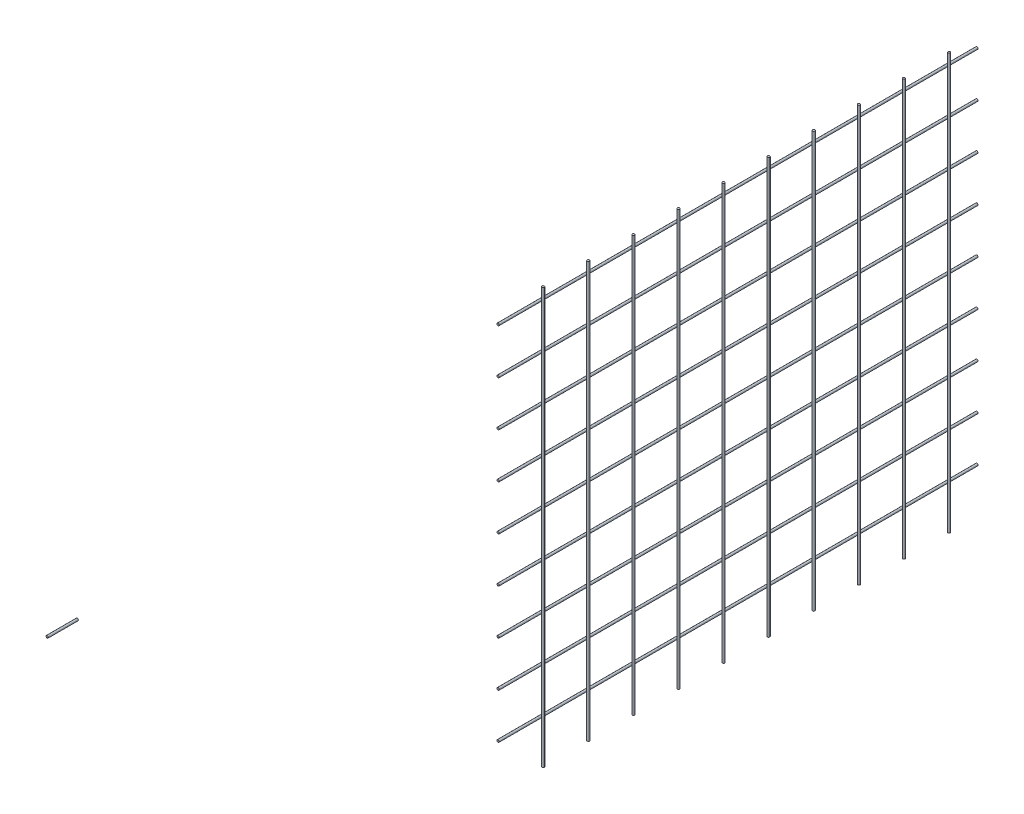
ISO-10303-21;
HEADER;
FILE_DESCRIPTION(('STEP AP214'),'2;1');
FILE_NAME('part.step','',(''),(''),'','','');
FILE_SCHEMA(('AUTOMOTIVE_DESIGN { 1 0 10303 214 1 1 1 1 }'));
ENDSEC;
DATA;
#1=APPLICATION_CONTEXT('core data for automotive mechanical design processes');
#2=APPLICATION_PROTOCOL_DEFINITION('international standard','automotive_design',2000,#1);
#3=PRODUCT_CONTEXT('',#1,'mechanical');
#4=PRODUCT('Part','Part','',(#3));
#5=PRODUCT_RELATED_PRODUCT_CATEGORY('part','',(#4));
#6=PRODUCT_DEFINITION_FORMATION('','',#4);
#7=PRODUCT_DEFINITION_CONTEXT('part definition',#1,'design');
#8=PRODUCT_DEFINITION('design','',#6,#7);
#9=PRODUCT_DEFINITION_SHAPE('','',#8);
#10=(LENGTH_UNIT() NAMED_UNIT(*) SI_UNIT(.MILLI.,.METRE.));
#11=(NAMED_UNIT(*) PLANE_ANGLE_UNIT() SI_UNIT($,.RADIAN.));
#12=(NAMED_UNIT(*) SI_UNIT($,.STERADIAN.) SOLID_ANGLE_UNIT());
#13=UNCERTAINTY_MEASURE_WITH_UNIT(LENGTH_MEASURE(1.E-05),#10,'distance_accuracy_value','');
#14=(GEOMETRIC_REPRESENTATION_CONTEXT(3) GLOBAL_UNCERTAINTY_ASSIGNED_CONTEXT((#13)) GLOBAL_UNIT_ASSIGNED_CONTEXT((#10,
#11,#12)) REPRESENTATION_CONTEXT('',''));
#15=CARTESIAN_POINT('',(0.,0.,0.));
#16=DIRECTION('',(0.,0.,1.));
#17=DIRECTION('',(1.,0.,0.));
#18=AXIS2_PLACEMENT_3D('',#15,#16,#17);
#19=CARTESIAN_POINT('',(-20.01,1256.5,-2403.));
#20=DIRECTION('',(0.,0.,1.));
#21=DIRECTION('',(1.,0.,0.));
#22=AXIS2_PLACEMENT_3D('',#19,#20,#21);
#23=PLANE('',#22);
#24=CARTESIAN_POINT('',(0.,760.,-2403.));
#25=DIRECTION('',(0.,0.,1.));
#26=DIRECTION('',(1.,0.,0.));
#27=AXIS2_PLACEMENT_3D('',#24,#25,#26);
#28=CIRCLE('',#27,1.49999999999986);
#29=CARTESIAN_POINT('',(1.49999999999986,760.,-2403.));
#30=VERTEX_POINT('',#29);
#31=EDGE_CURVE('E56',#30,#30,#28,.T.);
#32=ORIENTED_EDGE('',*,*,#31,.T.);
#33=EDGE_LOOP('',(#32));
#34=FACE_BOUND('',#33,.T.);
#35=ADVANCED_FACE('F52',(#34),#23,.T.);
#36=CARTESIAN_POINT('',(0.,760.,-3080.002));
#37=DIRECTION('',(0.,0.,1.));
#38=DIRECTION('',(1.,0.,0.));
#39=AXIS2_PLACEMENT_3D('',#36,#37,#38);
#40=CYLINDRICAL_SURFACE('',#39,1.49999999999986);
#41=CARTESIAN_POINT('',(0.,760.,-3040.));
#42=DIRECTION('',(0.,0.,-1.));
#43=DIRECTION('',(-1.,0.,0.));
#44=AXIS2_PLACEMENT_3D('',#41,#42,#43);
#45=CIRCLE('',#44,1.49999999999986);
#46=CARTESIAN_POINT('',(-1.49999999999986,760.,-3040.));
#47=VERTEX_POINT('',#46);
#48=EDGE_CURVE('E11',#47,#47,#45,.T.);
#49=ORIENTED_EDGE('',*,*,#48,.F.);
#50=EDGE_LOOP('',(#49));
#51=FACE_BOUND('',#50,.T.);
#52=ORIENTED_EDGE('',*,*,#31,.F.);
#53=EDGE_LOOP('',(#52));
#54=FACE_BOUND('',#53,.T.);
#55=ADVANCED_FACE('F54',(#51,#54),#40,.T.);
#56=CARTESIAN_POINT('',(-15.5,-2.22044604925031E-13,-3040.));
#57=DIRECTION('',(0.,0.,-1.));
#58=DIRECTION('',(-1.,0.,0.));
#59=AXIS2_PLACEMENT_3D('',#56,#57,#58);
#60=PLANE('',#59);
#61=ORIENTED_EDGE('',*,*,#48,.T.);
#62=EDGE_LOOP('',(#61));
#63=FACE_BOUND('',#62,.T.);
#64=ADVANCED_FACE('F67',(#63),#60,.T.);
#65=CLOSED_SHELL('',(#35,#55,#64));
#66=MANIFOLD_SOLID_BREP('B2',#65);
#67=CARTESIAN_POINT('',(-20.01,1256.5,-2403.));
#68=DIRECTION('',(0.,0.,1.));
#69=DIRECTION('',(1.,0.,0.));
#70=AXIS2_PLACEMENT_3D('',#67,#68,#69);
#71=PLANE('',#70);
#72=CARTESIAN_POINT('',(0.,820.,-2403.));
#73=DIRECTION('',(0.,0.,1.));
#74=DIRECTION('',(1.,0.,0.));
#75=AXIS2_PLACEMENT_3D('',#72,#73,#74);
#76=CIRCLE('',#75,1.49999999999986);
#77=CARTESIAN_POINT('',(1.49999999999986,820.,-2403.));
#78=VERTEX_POINT('',#77);
#79=EDGE_CURVE('E105',#78,#78,#76,.T.);
#80=ORIENTED_EDGE('',*,*,#79,.T.);
#81=EDGE_LOOP('',(#80));
#82=FACE_BOUND('',#81,.T.);
#83=ADVANCED_FACE('F101',(#82),#71,.T.);
#84=CARTESIAN_POINT('',(0.,820.,-3080.002));
#85=DIRECTION('',(0.,0.,1.));
#86=DIRECTION('',(1.,0.,0.));
#87=AXIS2_PLACEMENT_3D('',#84,#85,#86);
#88=CYLINDRICAL_SURFACE('',#87,1.49999999999986);
#89=CARTESIAN_POINT('',(0.,820.,-3040.));
#90=DIRECTION('',(0.,0.,-1.));
#91=DIRECTION('',(-1.,0.,0.));
#92=AXIS2_PLACEMENT_3D('',#89,#90,#91);
#93=CIRCLE('',#92,1.49999999999986);
#94=CARTESIAN_POINT('',(-1.49999999999986,820.,-3040.));
#95=VERTEX_POINT('',#94);
#96=EDGE_CURVE('E51',#95,#95,#93,.T.);
#97=ORIENTED_EDGE('',*,*,#96,.F.);
#98=EDGE_LOOP('',(#97));
#99=FACE_BOUND('',#98,.T.);
#100=ORIENTED_EDGE('',*,*,#79,.F.);
#101=EDGE_LOOP('',(#100));
#102=FACE_BOUND('',#101,.T.);
#103=ADVANCED_FACE('F103',(#99,#102),#88,.T.);
#104=CARTESIAN_POINT('',(-15.5,-2.22044604925031E-13,-3040.));
#105=DIRECTION('',(0.,0.,-1.));
#106=DIRECTION('',(-1.,0.,0.));
#107=AXIS2_PLACEMENT_3D('',#104,#105,#106);
#108=PLANE('',#107);
#109=ORIENTED_EDGE('',*,*,#96,.T.);
#110=EDGE_LOOP('',(#109));
#111=FACE_BOUND('',#110,.T.);
#112=ADVANCED_FACE('F116',(#111),#108,.T.);
#113=CLOSED_SHELL('',(#83,#103,#112));
#114=MANIFOLD_SOLID_BREP('B6',#113);
#115=CARTESIAN_POINT('',(-20.01,1256.5,-2403.));
#116=DIRECTION('',(0.,0.,1.));
#117=DIRECTION('',(1.,0.,0.));
#118=AXIS2_PLACEMENT_3D('',#115,#116,#117);
#119=PLANE('',#118);
#120=CARTESIAN_POINT('',(0.,880.,-2403.));
#121=DIRECTION('',(0.,0.,1.));
#122=DIRECTION('',(1.,0.,0.));
#123=AXIS2_PLACEMENT_3D('',#120,#121,#122);
#124=CIRCLE('',#123,1.49999999999986);
#125=CARTESIAN_POINT('',(1.49999999999986,880.,-2403.));
#126=VERTEX_POINT('',#125);
#127=EDGE_CURVE('E154',#126,#126,#124,.T.);
#128=ORIENTED_EDGE('',*,*,#127,.T.);
#129=EDGE_LOOP('',(#128));
#130=FACE_BOUND('',#129,.T.);
#131=ADVANCED_FACE('F150',(#130),#119,.T.);
#132=CARTESIAN_POINT('',(0.,880.,-3080.002));
#133=DIRECTION('',(0.,0.,1.));
#134=DIRECTION('',(1.,0.,0.));
#135=AXIS2_PLACEMENT_3D('',#132,#133,#134);
#136=CYLINDRICAL_SURFACE('',#135,1.49999999999986);
#137=CARTESIAN_POINT('',(0.,880.,-3040.));
#138=DIRECTION('',(0.,0.,-1.));
#139=DIRECTION('',(-1.,0.,0.));
#140=AXIS2_PLACEMENT_3D('',#137,#138,#139);
#141=CIRCLE('',#140,1.49999999999986);
#142=CARTESIAN_POINT('',(-1.49999999999986,880.,-3040.));
#143=VERTEX_POINT('',#142);
#144=EDGE_CURVE('E100',#143,#143,#141,.T.);
#145=ORIENTED_EDGE('',*,*,#144,.F.);
#146=EDGE_LOOP('',(#145));
#147=FACE_BOUND('',#146,.T.);
#148=ORIENTED_EDGE('',*,*,#127,.F.);
#149=EDGE_LOOP('',(#148));
#150=FACE_BOUND('',#149,.T.);
#151=ADVANCED_FACE('F152',(#147,#150),#136,.T.);
#152=CARTESIAN_POINT('',(-15.5,-2.22044604925031E-13,-3040.));
#153=DIRECTION('',(0.,0.,-1.));
#154=DIRECTION('',(-1.,0.,0.));
#155=AXIS2_PLACEMENT_3D('',#152,#153,#154);
#156=PLANE('',#155);
#157=ORIENTED_EDGE('',*,*,#144,.T.);
#158=EDGE_LOOP('',(#157));
#159=FACE_BOUND('',#158,.T.);
#160=ADVANCED_FACE('F165',(#159),#156,.T.);
#161=CLOSED_SHELL('',(#131,#151,#160));
#162=MANIFOLD_SOLID_BREP('B46',#161);
#163=CARTESIAN_POINT('',(-20.01,1256.5,-2403.));
#164=DIRECTION('',(0.,0.,1.));
#165=DIRECTION('',(1.,0.,0.));
#166=AXIS2_PLACEMENT_3D('',#163,#164,#165);
#167=PLANE('',#166);
#168=CARTESIAN_POINT('',(0.,940.,-2403.));
#169=DIRECTION('',(0.,0.,1.));
#170=DIRECTION('',(1.,0.,0.));
#171=AXIS2_PLACEMENT_3D('',#168,#169,#170);
#172=CIRCLE('',#171,1.49999999999986);
#173=CARTESIAN_POINT('',(1.49999999999986,940.,-2403.));
#174=VERTEX_POINT('',#173);
#175=EDGE_CURVE('E203',#174,#174,#172,.T.);
#176=ORIENTED_EDGE('',*,*,#175,.T.);
#177=EDGE_LOOP('',(#176));
#178=FACE_BOUND('',#177,.T.);
#179=ADVANCED_FACE('F199',(#178),#167,.T.);
#180=CARTESIAN_POINT('',(0.,940.,-3080.002));
#181=DIRECTION('',(0.,0.,1.));
#182=DIRECTION('',(1.,0.,0.));
#183=AXIS2_PLACEMENT_3D('',#180,#181,#182);
#184=CYLINDRICAL_SURFACE('',#183,1.49999999999986);
#185=CARTESIAN_POINT('',(0.,940.,-3040.));
#186=DIRECTION('',(0.,0.,-1.));
#187=DIRECTION('',(-1.,0.,0.));
#188=AXIS2_PLACEMENT_3D('',#185,#186,#187);
#189=CIRCLE('',#188,1.49999999999986);
#190=CARTESIAN_POINT('',(-1.49999999999986,940.,-3040.));
#191=VERTEX_POINT('',#190);
#192=EDGE_CURVE('E149',#191,#191,#189,.T.);
#193=ORIENTED_EDGE('',*,*,#192,.F.);
#194=EDGE_LOOP('',(#193));
#195=FACE_BOUND('',#194,.T.);
#196=ORIENTED_EDGE('',*,*,#175,.F.);
#197=EDGE_LOOP('',(#196));
#198=FACE_BOUND('',#197,.T.);
#199=ADVANCED_FACE('F201',(#195,#198),#184,.T.);
#200=CARTESIAN_POINT('',(-15.5,-2.22044604925031E-13,-3040.));
#201=DIRECTION('',(0.,0.,-1.));
#202=DIRECTION('',(-1.,0.,0.));
#203=AXIS2_PLACEMENT_3D('',#200,#201,#202);
#204=PLANE('',#203);
#205=ORIENTED_EDGE('',*,*,#192,.T.);
#206=EDGE_LOOP('',(#205));
#207=FACE_BOUND('',#206,.T.);
#208=ADVANCED_FACE('F214',(#207),#204,.T.);
#209=CLOSED_SHELL('',(#179,#199,#208));
#210=MANIFOLD_SOLID_BREP('B95',#209);
#211=CARTESIAN_POINT('',(-20.01,1256.5,-2403.));
#212=DIRECTION('',(0.,0.,1.));
#213=DIRECTION('',(1.,0.,0.));
#214=AXIS2_PLACEMENT_3D('',#211,#212,#213);
#215=PLANE('',#214);
#216=CARTESIAN_POINT('',(0.,1000.,-2403.));
#217=DIRECTION('',(0.,0.,1.));
#218=DIRECTION('',(1.,0.,0.));
#219=AXIS2_PLACEMENT_3D('',#216,#217,#218);
#220=CIRCLE('',#219,1.49999999999986);
#221=CARTESIAN_POINT('',(1.49999999999986,1000.,-2403.));
#222=VERTEX_POINT('',#221);
#223=EDGE_CURVE('E252',#222,#222,#220,.T.);
#224=ORIENTED_EDGE('',*,*,#223,.T.);
#225=EDGE_LOOP('',(#224));
#226=FACE_BOUND('',#225,.T.);
#227=ADVANCED_FACE('F248',(#226),#215,.T.);
#228=CARTESIAN_POINT('',(0.,1000.,-3080.002));
#229=DIRECTION('',(0.,0.,1.));
#230=DIRECTION('',(1.,0.,0.));
#231=AXIS2_PLACEMENT_3D('',#228,#229,#230);
#232=CYLINDRICAL_SURFACE('',#231,1.49999999999986);
#233=CARTESIAN_POINT('',(0.,1000.,-3040.));
#234=DIRECTION('',(0.,0.,-1.));
#235=DIRECTION('',(-1.,0.,0.));
#236=AXIS2_PLACEMENT_3D('',#233,#234,#235);
#237=CIRCLE('',#236,1.49999999999986);
#238=CARTESIAN_POINT('',(-1.49999999999986,1000.,-3040.));
#239=VERTEX_POINT('',#238);
#240=EDGE_CURVE('E198',#239,#239,#237,.T.);
#241=ORIENTED_EDGE('',*,*,#240,.F.);
#242=EDGE_LOOP('',(#241));
#243=FACE_BOUND('',#242,.T.);
#244=ORIENTED_EDGE('',*,*,#223,.F.);
#245=EDGE_LOOP('',(#244));
#246=FACE_BOUND('',#245,.T.);
#247=ADVANCED_FACE('F250',(#243,#246),#232,.T.);
#248=CARTESIAN_POINT('',(-15.5,-2.22044604925031E-13,-3040.));
#249=DIRECTION('',(0.,0.,-1.));
#250=DIRECTION('',(-1.,0.,0.));
#251=AXIS2_PLACEMENT_3D('',#248,#249,#250);
#252=PLANE('',#251);
#253=ORIENTED_EDGE('',*,*,#240,.T.);
#254=EDGE_LOOP('',(#253));
#255=FACE_BOUND('',#254,.T.);
#256=ADVANCED_FACE('F263',(#255),#252,.T.);
#257=CLOSED_SHELL('',(#227,#247,#256));
#258=MANIFOLD_SOLID_BREP('B144',#257);
#259=CARTESIAN_POINT('',(-20.01,1256.5,-2403.));
#260=DIRECTION('',(0.,0.,1.));
#261=DIRECTION('',(1.,0.,0.));
#262=AXIS2_PLACEMENT_3D('',#259,#260,#261);
#263=PLANE('',#262);
#264=CARTESIAN_POINT('',(0.,1060.,-2403.));
#265=DIRECTION('',(0.,0.,1.));
#266=DIRECTION('',(1.,0.,0.));
#267=AXIS2_PLACEMENT_3D('',#264,#265,#266);
#268=CIRCLE('',#267,1.49999999999986);
#269=CARTESIAN_POINT('',(1.49999999999986,1060.,-2403.));
#270=VERTEX_POINT('',#269);
#271=EDGE_CURVE('E301',#270,#270,#268,.T.);
#272=ORIENTED_EDGE('',*,*,#271,.T.);
#273=EDGE_LOOP('',(#272));
#274=FACE_BOUND('',#273,.T.);
#275=ADVANCED_FACE('F297',(#274),#263,.T.);
#276=CARTESIAN_POINT('',(0.,1060.,-3080.002));
#277=DIRECTION('',(0.,0.,1.));
#278=DIRECTION('',(1.,0.,0.));
#279=AXIS2_PLACEMENT_3D('',#276,#277,#278);
#280=CYLINDRICAL_SURFACE('',#279,1.49999999999986);
#281=CARTESIAN_POINT('',(0.,1060.,-3040.));
#282=DIRECTION('',(0.,0.,-1.));
#283=DIRECTION('',(-1.,0.,0.));
#284=AXIS2_PLACEMENT_3D('',#281,#282,#283);
#285=CIRCLE('',#284,1.49999999999986);
#286=CARTESIAN_POINT('',(-1.49999999999986,1060.,-3040.));
#287=VERTEX_POINT('',#286);
#288=EDGE_CURVE('E247',#287,#287,#285,.T.);
#289=ORIENTED_EDGE('',*,*,#288,.F.);
#290=EDGE_LOOP('',(#289));
#291=FACE_BOUND('',#290,.T.);
#292=ORIENTED_EDGE('',*,*,#271,.F.);
#293=EDGE_LOOP('',(#292));
#294=FACE_BOUND('',#293,.T.);
#295=ADVANCED_FACE('F299',(#291,#294),#280,.T.);
#296=CARTESIAN_POINT('',(-15.5,-2.22044604925031E-13,-3040.));
#297=DIRECTION('',(0.,0.,-1.));
#298=DIRECTION('',(-1.,0.,0.));
#299=AXIS2_PLACEMENT_3D('',#296,#297,#298);
#300=PLANE('',#299);
#301=ORIENTED_EDGE('',*,*,#288,.T.);
#302=EDGE_LOOP('',(#301));
#303=FACE_BOUND('',#302,.T.);
#304=ADVANCED_FACE('F313',(#303),#300,.T.);
#305=CLOSED_SHELL('',(#275,#295,#304));
#306=MANIFOLD_SOLID_BREP('B193',#305);
#307=CARTESIAN_POINT('',(-20.01,1256.5,-2403.));
#308=DIRECTION('',(0.,0.,1.));
#309=DIRECTION('',(1.,0.,0.));
#310=AXIS2_PLACEMENT_3D('',#307,#308,#309);
#311=PLANE('',#310);
#312=CARTESIAN_POINT('',(0.,1120.,-2403.));
#313=DIRECTION('',(0.,0.,1.));
#314=DIRECTION('',(1.,0.,0.));
#315=AXIS2_PLACEMENT_3D('',#312,#313,#314);
#316=CIRCLE('',#315,1.49999999999986);
#317=CARTESIAN_POINT('',(1.49999999999986,1120.,-2403.));
#318=VERTEX_POINT('',#317);
#319=EDGE_CURVE('E351',#318,#318,#316,.T.);
#320=ORIENTED_EDGE('',*,*,#319,.T.);
#321=EDGE_LOOP('',(#320));
#322=FACE_BOUND('',#321,.T.);
#323=ADVANCED_FACE('F347',(#322),#311,.T.);
#324=CARTESIAN_POINT('',(0.,1120.,-3080.002));
#325=DIRECTION('',(0.,0.,1.));
#326=DIRECTION('',(1.,0.,0.));
#327=AXIS2_PLACEMENT_3D('',#324,#325,#326);
#328=CYLINDRICAL_SURFACE('',#327,1.49999999999986);
#329=CARTESIAN_POINT('',(0.,1120.,-3040.));
#330=DIRECTION('',(0.,0.,-1.));
#331=DIRECTION('',(-1.,0.,0.));
#332=AXIS2_PLACEMENT_3D('',#329,#330,#331);
#333=CIRCLE('',#332,1.49999999999986);
#334=CARTESIAN_POINT('',(-1.49999999999986,1120.,-3040.));
#335=VERTEX_POINT('',#334);
#336=EDGE_CURVE('E296',#335,#335,#333,.T.);
#337=ORIENTED_EDGE('',*,*,#336,.F.);
#338=EDGE_LOOP('',(#337));
#339=FACE_BOUND('',#338,.T.);
#340=ORIENTED_EDGE('',*,*,#319,.F.);
#341=EDGE_LOOP('',(#340));
#342=FACE_BOUND('',#341,.T.);
#343=ADVANCED_FACE('F349',(#339,#342),#328,.T.);
#344=CARTESIAN_POINT('',(-15.5,-2.22044604925031E-13,-3040.));
#345=DIRECTION('',(0.,0.,-1.));
#346=DIRECTION('',(-1.,0.,0.));
#347=AXIS2_PLACEMENT_3D('',#344,#345,#346);
#348=PLANE('',#347);
#349=ORIENTED_EDGE('',*,*,#336,.T.);
#350=EDGE_LOOP('',(#349));
#351=FACE_BOUND('',#350,.T.);
#352=ADVANCED_FACE('F363',(#351),#348,.T.);
#353=CLOSED_SHELL('',(#323,#343,#352));
#354=MANIFOLD_SOLID_BREP('B242',#353);
#355=CARTESIAN_POINT('',(-20.01,1256.5,-2403.));
#356=DIRECTION('',(0.,0.,1.));
#357=DIRECTION('',(1.,0.,0.));
#358=AXIS2_PLACEMENT_3D('',#355,#356,#357);
#359=PLANE('',#358);
#360=CARTESIAN_POINT('',(0.,1180.,-2403.));
#361=DIRECTION('',(0.,0.,1.));
#362=DIRECTION('',(1.,0.,0.));
#363=AXIS2_PLACEMENT_3D('',#360,#361,#362);
#364=CIRCLE('',#363,1.49999999999986);
#365=CARTESIAN_POINT('',(1.49999999999986,1180.,-2403.));
#366=VERTEX_POINT('',#365);
#367=EDGE_CURVE('E401',#366,#366,#364,.T.);
#368=ORIENTED_EDGE('',*,*,#367,.T.);
#369=EDGE_LOOP('',(#368));
#370=FACE_BOUND('',#369,.T.);
#371=ADVANCED_FACE('F397',(#370),#359,.T.);
#372=CARTESIAN_POINT('',(0.,1180.,-3080.002));
#373=DIRECTION('',(0.,0.,1.));
#374=DIRECTION('',(1.,0.,0.));
#375=AXIS2_PLACEMENT_3D('',#372,#373,#374);
#376=CYLINDRICAL_SURFACE('',#375,1.49999999999986);
#377=CARTESIAN_POINT('',(0.,1180.,-3040.));
#378=DIRECTION('',(0.,0.,-1.));
#379=DIRECTION('',(-1.,0.,0.));
#380=AXIS2_PLACEMENT_3D('',#377,#378,#379);
#381=CIRCLE('',#380,1.49999999999986);
#382=CARTESIAN_POINT('',(-1.49999999999986,1180.,-3040.));
#383=VERTEX_POINT('',#382);
#384=EDGE_CURVE('E346',#383,#383,#381,.T.);
#385=ORIENTED_EDGE('',*,*,#384,.F.);
#386=EDGE_LOOP('',(#385));
#387=FACE_BOUND('',#386,.T.);
#388=ORIENTED_EDGE('',*,*,#367,.F.);
#389=EDGE_LOOP('',(#388));
#390=FACE_BOUND('',#389,.T.);
#391=ADVANCED_FACE('F399',(#387,#390),#376,.T.);
#392=CARTESIAN_POINT('',(-15.5,-2.22044604925031E-13,-3040.));
#393=DIRECTION('',(0.,0.,-1.));
#394=DIRECTION('',(-1.,0.,0.));
#395=AXIS2_PLACEMENT_3D('',#392,#393,#394);
#396=PLANE('',#395);
#397=ORIENTED_EDGE('',*,*,#384,.T.);
#398=EDGE_LOOP('',(#397));
#399=FACE_BOUND('',#398,.T.);
#400=ADVANCED_FACE('F412',(#399),#396,.T.);
#401=CLOSED_SHELL('',(#371,#391,#400));
#402=MANIFOLD_SOLID_BREP('B291',#401);
#403=CARTESIAN_POINT('',(-20.01,1256.5,-2403.));
#404=DIRECTION('',(0.,0.,1.));
#405=DIRECTION('',(1.,0.,0.));
#406=AXIS2_PLACEMENT_3D('',#403,#404,#405);
#407=PLANE('',#406);
#408=CARTESIAN_POINT('',(0.,1240.,-2403.));
#409=DIRECTION('',(0.,0.,1.));
#410=DIRECTION('',(1.,0.,0.));
#411=AXIS2_PLACEMENT_3D('',#408,#409,#410);
#412=CIRCLE('',#411,1.49999999999986);
#413=CARTESIAN_POINT('',(1.49999999999986,1240.,-2403.));
#414=VERTEX_POINT('',#413);
#415=EDGE_CURVE('E450',#414,#414,#412,.T.);
#416=ORIENTED_EDGE('',*,*,#415,.T.);
#417=EDGE_LOOP('',(#416));
#418=FACE_BOUND('',#417,.T.);
#419=ADVANCED_FACE('F446',(#418),#407,.T.);
#420=CARTESIAN_POINT('',(0.,1240.,-3080.002));
#421=DIRECTION('',(0.,0.,1.));
#422=DIRECTION('',(1.,0.,0.));
#423=AXIS2_PLACEMENT_3D('',#420,#421,#422);
#424=CYLINDRICAL_SURFACE('',#423,1.49999999999986);
#425=CARTESIAN_POINT('',(0.,1240.,-3040.));
#426=DIRECTION('',(0.,0.,-1.));
#427=DIRECTION('',(-1.,0.,0.));
#428=AXIS2_PLACEMENT_3D('',#425,#426,#427);
#429=CIRCLE('',#428,1.49999999999986);
#430=CARTESIAN_POINT('',(-1.49999999999986,1240.,-3040.));
#431=VERTEX_POINT('',#430);
#432=EDGE_CURVE('E396',#431,#431,#429,.T.);
#433=ORIENTED_EDGE('',*,*,#432,.F.);
#434=EDGE_LOOP('',(#433));
#435=FACE_BOUND('',#434,.T.);
#436=ORIENTED_EDGE('',*,*,#415,.F.);
#437=EDGE_LOOP('',(#436));
#438=FACE_BOUND('',#437,.T.);
#439=ADVANCED_FACE('F448',(#435,#438),#424,.T.);
#440=CARTESIAN_POINT('',(-15.5,-2.22044604925031E-13,-3040.));
#441=DIRECTION('',(0.,0.,-1.));
#442=DIRECTION('',(-1.,0.,0.));
#443=AXIS2_PLACEMENT_3D('',#440,#441,#442);
#444=PLANE('',#443);
#445=ORIENTED_EDGE('',*,*,#432,.T.);
#446=EDGE_LOOP('',(#445));
#447=FACE_BOUND('',#446,.T.);
#448=ADVANCED_FACE('F461',(#447),#444,.T.);
#449=CLOSED_SHELL('',(#419,#439,#448));
#450=MANIFOLD_SOLID_BREP('B341',#449);
#451=CARTESIAN_POINT('',(-20.01,1256.5,-1803.));
#452=DIRECTION('',(0.,0.,-1.));
#453=DIRECTION('',(0.,1.,0.));
#454=AXIS2_PLACEMENT_3D('',#451,#452,#453);
#455=PLANE('',#454);
#456=CARTESIAN_POINT('',(0.,1180.,-1803.));
#457=DIRECTION('',(0.,0.,-1.));
#458=DIRECTION('',(0.,1.,0.));
#459=AXIS2_PLACEMENT_3D('',#456,#457,#458);
#460=CIRCLE('',#459,1.49999999999986);
#461=CARTESIAN_POINT('',(0.,1181.5,-1803.));
#462=VERTEX_POINT('',#461);
#463=EDGE_CURVE('E445',#462,#462,#460,.T.);
#464=ORIENTED_EDGE('',*,*,#463,.F.);
#465=EDGE_LOOP('',(#464));
#466=FACE_BOUND('',#465,.T.);
#467=ADVANCED_FACE('F495',(#466),#455,.F.);
#468=CARTESIAN_POINT('',(-11.,1249.,-1843.));
#469=DIRECTION('',(0.,0.,1.));
#470=DIRECTION('',(1.,0.,0.));
#471=AXIS2_PLACEMENT_3D('',#468,#469,#470);
#472=PLANE('',#471);
#473=CARTESIAN_POINT('',(0.,1180.,-1843.));
#474=DIRECTION('',(0.,0.,1.));
#475=DIRECTION('',(1.,0.,0.));
#476=AXIS2_PLACEMENT_3D('',#473,#474,#475);
#477=CIRCLE('',#476,1.49999999999986);
#478=CARTESIAN_POINT('',(1.49999999999986,1180.,-1843.));
#479=VERTEX_POINT('',#478);
#480=EDGE_CURVE('E502',#479,#479,#477,.T.);
#481=ORIENTED_EDGE('',*,*,#480,.F.);
#482=EDGE_LOOP('',(#481));
#483=FACE_BOUND('',#482,.T.);
#484=ADVANCED_FACE('F511',(#483),#472,.F.);
#485=CARTESIAN_POINT('',(0.,1180.,-3080.002));
#486=DIRECTION('',(0.,0.,1.));
#487=DIRECTION('',(1.,0.,0.));
#488=AXIS2_PLACEMENT_3D('',#485,#486,#487);
#489=CYLINDRICAL_SURFACE('',#488,1.49999999999986);
#490=ORIENTED_EDGE('',*,*,#463,.T.);
#491=EDGE_LOOP('',(#490));
#492=FACE_BOUND('',#491,.T.);
#493=ORIENTED_EDGE('',*,*,#480,.T.);
#494=EDGE_LOOP('',(#493));
#495=FACE_BOUND('',#494,.T.);
#496=ADVANCED_FACE('F509',(#492,#495),#489,.T.);
#497=CLOSED_SHELL('',(#467,#484,#496));
#498=MANIFOLD_SOLID_BREP('B391',#497);
#499=CARTESIAN_POINT('',(-20.01,703.5,-2403.));
#500=DIRECTION('',(0.,-1.,0.));
#501=DIRECTION('',(0.,0.,-1.));
#502=AXIS2_PLACEMENT_3D('',#499,#500,#501);
#503=PLANE('',#502);
#504=CARTESIAN_POINT('',(2.99999999999999,703.5,-3000.));
#505=DIRECTION('',(0.,-1.,0.));
#506=DIRECTION('',(0.,0.,-1.));
#507=AXIS2_PLACEMENT_3D('',#504,#505,#506);
#508=CIRCLE('',#507,1.5);
#509=CARTESIAN_POINT('',(2.99999999999999,703.5,-3001.5));
#510=VERTEX_POINT('',#509);
#511=EDGE_CURVE('E494',#510,#510,#508,.T.);
#512=ORIENTED_EDGE('',*,*,#511,.T.);
#513=EDGE_LOOP('',(#512));
#514=FACE_BOUND('',#513,.T.);
#515=ADVANCED_FACE('F548',(#514),#503,.T.);
#516=CARTESIAN_POINT('',(-20.01,1256.5,-2403.));
#517=DIRECTION('',(0.,1.,0.));
#518=DIRECTION('',(0.,0.,1.));
#519=AXIS2_PLACEMENT_3D('',#516,#517,#518);
#520=PLANE('',#519);
#521=CARTESIAN_POINT('',(2.99999999999999,1256.5,-3000.));
#522=DIRECTION('',(0.,1.,0.));
#523=DIRECTION('',(0.,0.,1.));
#524=AXIS2_PLACEMENT_3D('',#521,#522,#523);
#525=CIRCLE('',#524,1.5);
#526=CARTESIAN_POINT('',(2.99999999999999,1256.5,-2998.5));
#527=VERTEX_POINT('',#526);
#528=EDGE_CURVE('E555',#527,#527,#525,.T.);
#529=ORIENTED_EDGE('',*,*,#528,.T.);
#530=EDGE_LOOP('',(#529));
#531=FACE_BOUND('',#530,.T.);
#532=ADVANCED_FACE('F561',(#531),#520,.T.);
#533=CARTESIAN_POINT('',(2.99999999999999,1980.002,-3000.));
#534=DIRECTION('',(0.,-1.,0.));
#535=DIRECTION('',(0.,0.,-1.));
#536=AXIS2_PLACEMENT_3D('',#533,#534,#535);
#537=CYLINDRICAL_SURFACE('',#536,1.5);
#538=ORIENTED_EDGE('',*,*,#528,.F.);
#539=EDGE_LOOP('',(#538));
#540=FACE_BOUND('',#539,.T.);
#541=ORIENTED_EDGE('',*,*,#511,.F.);
#542=EDGE_LOOP('',(#541));
#543=FACE_BOUND('',#542,.T.);
#544=ADVANCED_FACE('F550',(#540,#543),#537,.T.);
#545=CLOSED_SHELL('',(#515,#532,#544));
#546=MANIFOLD_SOLID_BREP('B440',#545);
#547=CARTESIAN_POINT('',(-20.01,703.5,-2403.));
#548=DIRECTION('',(0.,-1.,0.));
#549=DIRECTION('',(0.,0.,-1.));
#550=AXIS2_PLACEMENT_3D('',#547,#548,#549);
#551=PLANE('',#550);
#552=CARTESIAN_POINT('',(2.99999999999999,703.5,-2940.));
#553=DIRECTION('',(0.,-1.,0.));
#554=DIRECTION('',(0.,0.,-1.));
#555=AXIS2_PLACEMENT_3D('',#552,#553,#554);
#556=CIRCLE('',#555,1.5);
#557=CARTESIAN_POINT('',(2.99999999999999,703.5,-2941.5));
#558=VERTEX_POINT('',#557);
#559=EDGE_CURVE('E547',#558,#558,#556,.T.);
#560=ORIENTED_EDGE('',*,*,#559,.T.);
#561=EDGE_LOOP('',(#560));
#562=FACE_BOUND('',#561,.T.);
#563=ADVANCED_FACE('F597',(#562),#551,.T.);
#564=CARTESIAN_POINT('',(-20.01,1256.5,-2403.));
#565=DIRECTION('',(0.,1.,0.));
#566=DIRECTION('',(0.,0.,1.));
#567=AXIS2_PLACEMENT_3D('',#564,#565,#566);
#568=PLANE('',#567);
#569=CARTESIAN_POINT('',(2.99999999999999,1256.5,-2940.));
#570=DIRECTION('',(0.,1.,0.));
#571=DIRECTION('',(0.,0.,1.));
#572=AXIS2_PLACEMENT_3D('',#569,#570,#571);
#573=CIRCLE('',#572,1.5);
#574=CARTESIAN_POINT('',(2.99999999999999,1256.5,-2938.5));
#575=VERTEX_POINT('',#574);
#576=EDGE_CURVE('E604',#575,#575,#573,.T.);
#577=ORIENTED_EDGE('',*,*,#576,.T.);
#578=EDGE_LOOP('',(#577));
#579=FACE_BOUND('',#578,.T.);
#580=ADVANCED_FACE('F610',(#579),#568,.T.);
#581=CARTESIAN_POINT('',(2.99999999999999,1980.002,-2940.));
#582=DIRECTION('',(0.,-1.,0.));
#583=DIRECTION('',(0.,0.,-1.));
#584=AXIS2_PLACEMENT_3D('',#581,#582,#583);
#585=CYLINDRICAL_SURFACE('',#584,1.5);
#586=ORIENTED_EDGE('',*,*,#576,.F.);
#587=EDGE_LOOP('',(#586));
#588=FACE_BOUND('',#587,.T.);
#589=ORIENTED_EDGE('',*,*,#559,.F.);
#590=EDGE_LOOP('',(#589));
#591=FACE_BOUND('',#590,.T.);
#592=ADVANCED_FACE('F599',(#588,#591),#585,.T.);
#593=CLOSED_SHELL('',(#563,#580,#592));
#594=MANIFOLD_SOLID_BREP('B489',#593);
#595=CARTESIAN_POINT('',(-20.01,703.5,-2403.));
#596=DIRECTION('',(0.,-1.,0.));
#597=DIRECTION('',(0.,0.,-1.));
#598=AXIS2_PLACEMENT_3D('',#595,#596,#597);
#599=PLANE('',#598);
#600=CARTESIAN_POINT('',(2.99999999999999,703.5,-2880.));
#601=DIRECTION('',(0.,-1.,0.));
#602=DIRECTION('',(0.,0.,-1.));
#603=AXIS2_PLACEMENT_3D('',#600,#601,#602);
#604=CIRCLE('',#603,1.5);
#605=CARTESIAN_POINT('',(2.99999999999999,703.5,-2881.5));
#606=VERTEX_POINT('',#605);
#607=EDGE_CURVE('E596',#606,#606,#604,.T.);
#608=ORIENTED_EDGE('',*,*,#607,.T.);
#609=EDGE_LOOP('',(#608));
#610=FACE_BOUND('',#609,.T.);
#611=ADVANCED_FACE('F646',(#610),#599,.T.);
#612=CARTESIAN_POINT('',(-20.01,1256.5,-2403.));
#613=DIRECTION('',(0.,1.,0.));
#614=DIRECTION('',(0.,0.,1.));
#615=AXIS2_PLACEMENT_3D('',#612,#613,#614);
#616=PLANE('',#615);
#617=CARTESIAN_POINT('',(2.99999999999999,1256.5,-2880.));
#618=DIRECTION('',(0.,1.,0.));
#619=DIRECTION('',(0.,0.,1.));
#620=AXIS2_PLACEMENT_3D('',#617,#618,#619);
#621=CIRCLE('',#620,1.5);
#622=CARTESIAN_POINT('',(2.99999999999999,1256.5,-2878.5));
#623=VERTEX_POINT('',#622);
#624=EDGE_CURVE('E653',#623,#623,#621,.T.);
#625=ORIENTED_EDGE('',*,*,#624,.T.);
#626=EDGE_LOOP('',(#625));
#627=FACE_BOUND('',#626,.T.);
#628=ADVANCED_FACE('F659',(#627),#616,.T.);
#629=CARTESIAN_POINT('',(2.99999999999999,1980.002,-2880.));
#630=DIRECTION('',(0.,-1.,0.));
#631=DIRECTION('',(0.,0.,-1.));
#632=AXIS2_PLACEMENT_3D('',#629,#630,#631);
#633=CYLINDRICAL_SURFACE('',#632,1.5);
#634=ORIENTED_EDGE('',*,*,#624,.F.);
#635=EDGE_LOOP('',(#634));
#636=FACE_BOUND('',#635,.T.);
#637=ORIENTED_EDGE('',*,*,#607,.F.);
#638=EDGE_LOOP('',(#637));
#639=FACE_BOUND('',#638,.T.);
#640=ADVANCED_FACE('F648',(#636,#639),#633,.T.);
#641=CLOSED_SHELL('',(#611,#628,#640));
#642=MANIFOLD_SOLID_BREP('B542',#641);
#643=CARTESIAN_POINT('',(-20.01,703.5,-2403.));
#644=DIRECTION('',(0.,-1.,0.));
#645=DIRECTION('',(0.,0.,-1.));
#646=AXIS2_PLACEMENT_3D('',#643,#644,#645);
#647=PLANE('',#646);
#648=CARTESIAN_POINT('',(2.99999999999999,703.5,-2820.));
#649=DIRECTION('',(0.,-1.,0.));
#650=DIRECTION('',(0.,0.,-1.));
#651=AXIS2_PLACEMENT_3D('',#648,#649,#650);
#652=CIRCLE('',#651,1.5);
#653=CARTESIAN_POINT('',(2.99999999999999,703.5,-2821.5));
#654=VERTEX_POINT('',#653);
#655=EDGE_CURVE('E645',#654,#654,#652,.T.);
#656=ORIENTED_EDGE('',*,*,#655,.T.);
#657=EDGE_LOOP('',(#656));
#658=FACE_BOUND('',#657,.T.);
#659=ADVANCED_FACE('F695',(#658),#647,.T.);
#660=CARTESIAN_POINT('',(-20.01,1256.5,-2403.));
#661=DIRECTION('',(0.,1.,0.));
#662=DIRECTION('',(0.,0.,1.));
#663=AXIS2_PLACEMENT_3D('',#660,#661,#662);
#664=PLANE('',#663);
#665=CARTESIAN_POINT('',(2.99999999999999,1256.5,-2820.));
#666=DIRECTION('',(0.,1.,0.));
#667=DIRECTION('',(0.,0.,1.));
#668=AXIS2_PLACEMENT_3D('',#665,#666,#667);
#669=CIRCLE('',#668,1.5);
#670=CARTESIAN_POINT('',(2.99999999999999,1256.5,-2818.5));
#671=VERTEX_POINT('',#670);
#672=EDGE_CURVE('E702',#671,#671,#669,.T.);
#673=ORIENTED_EDGE('',*,*,#672,.T.);
#674=EDGE_LOOP('',(#673));
#675=FACE_BOUND('',#674,.T.);
#676=ADVANCED_FACE('F708',(#675),#664,.T.);
#677=CARTESIAN_POINT('',(2.99999999999999,1980.002,-2820.));
#678=DIRECTION('',(0.,-1.,0.));
#679=DIRECTION('',(0.,0.,-1.));
#680=AXIS2_PLACEMENT_3D('',#677,#678,#679);
#681=CYLINDRICAL_SURFACE('',#680,1.5);
#682=ORIENTED_EDGE('',*,*,#672,.F.);
#683=EDGE_LOOP('',(#682));
#684=FACE_BOUND('',#683,.T.);
#685=ORIENTED_EDGE('',*,*,#655,.F.);
#686=EDGE_LOOP('',(#685));
#687=FACE_BOUND('',#686,.T.);
#688=ADVANCED_FACE('F697',(#684,#687),#681,.T.);
#689=CLOSED_SHELL('',(#659,#676,#688));
#690=MANIFOLD_SOLID_BREP('B591',#689);
#691=CARTESIAN_POINT('',(-20.01,703.5,-2403.));
#692=DIRECTION('',(0.,-1.,0.));
#693=DIRECTION('',(0.,0.,-1.));
#694=AXIS2_PLACEMENT_3D('',#691,#692,#693);
#695=PLANE('',#694);
#696=CARTESIAN_POINT('',(2.99999999999999,703.5,-2760.));
#697=DIRECTION('',(0.,-1.,0.));
#698=DIRECTION('',(0.,0.,-1.));
#699=AXIS2_PLACEMENT_3D('',#696,#697,#698);
#700=CIRCLE('',#699,1.5);
#701=CARTESIAN_POINT('',(2.99999999999999,703.5,-2761.5));
#702=VERTEX_POINT('',#701);
#703=EDGE_CURVE('E694',#702,#702,#700,.T.);
#704=ORIENTED_EDGE('',*,*,#703,.T.);
#705=EDGE_LOOP('',(#704));
#706=FACE_BOUND('',#705,.T.);
#707=ADVANCED_FACE('F744',(#706),#695,.T.);
#708=CARTESIAN_POINT('',(-20.01,1256.5,-2403.));
#709=DIRECTION('',(0.,1.,0.));
#710=DIRECTION('',(0.,0.,1.));
#711=AXIS2_PLACEMENT_3D('',#708,#709,#710);
#712=PLANE('',#711);
#713=CARTESIAN_POINT('',(2.99999999999999,1256.5,-2760.));
#714=DIRECTION('',(0.,1.,0.));
#715=DIRECTION('',(0.,0.,1.));
#716=AXIS2_PLACEMENT_3D('',#713,#714,#715);
#717=CIRCLE('',#716,1.5);
#718=CARTESIAN_POINT('',(2.99999999999999,1256.5,-2758.5));
#719=VERTEX_POINT('',#718);
#720=EDGE_CURVE('E751',#719,#719,#717,.T.);
#721=ORIENTED_EDGE('',*,*,#720,.T.);
#722=EDGE_LOOP('',(#721));
#723=FACE_BOUND('',#722,.T.);
#724=ADVANCED_FACE('F757',(#723),#712,.T.);
#725=CARTESIAN_POINT('',(2.99999999999999,1980.002,-2760.));
#726=DIRECTION('',(0.,-1.,0.));
#727=DIRECTION('',(0.,0.,-1.));
#728=AXIS2_PLACEMENT_3D('',#725,#726,#727);
#729=CYLINDRICAL_SURFACE('',#728,1.5);
#730=ORIENTED_EDGE('',*,*,#720,.F.);
#731=EDGE_LOOP('',(#730));
#732=FACE_BOUND('',#731,.T.);
#733=ORIENTED_EDGE('',*,*,#703,.F.);
#734=EDGE_LOOP('',(#733));
#735=FACE_BOUND('',#734,.T.);
#736=ADVANCED_FACE('F746',(#732,#735),#729,.T.);
#737=CLOSED_SHELL('',(#707,#724,#736));
#738=MANIFOLD_SOLID_BREP('B640',#737);
#739=CARTESIAN_POINT('',(-20.01,703.5,-2403.));
#740=DIRECTION('',(0.,-1.,0.));
#741=DIRECTION('',(0.,0.,-1.));
#742=AXIS2_PLACEMENT_3D('',#739,#740,#741);
#743=PLANE('',#742);
#744=CARTESIAN_POINT('',(2.99999999999999,703.5,-2700.));
#745=DIRECTION('',(0.,-1.,0.));
#746=DIRECTION('',(0.,0.,-1.));
#747=AXIS2_PLACEMENT_3D('',#744,#745,#746);
#748=CIRCLE('',#747,1.5);
#749=CARTESIAN_POINT('',(2.99999999999999,703.5,-2701.5));
#750=VERTEX_POINT('',#749);
#751=EDGE_CURVE('E743',#750,#750,#748,.T.);
#752=ORIENTED_EDGE('',*,*,#751,.T.);
#753=EDGE_LOOP('',(#752));
#754=FACE_BOUND('',#753,.T.);
#755=ADVANCED_FACE('F793',(#754),#743,.T.);
#756=CARTESIAN_POINT('',(-20.01,1256.5,-2403.));
#757=DIRECTION('',(0.,1.,0.));
#758=DIRECTION('',(0.,0.,1.));
#759=AXIS2_PLACEMENT_3D('',#756,#757,#758);
#760=PLANE('',#759);
#761=CARTESIAN_POINT('',(2.99999999999999,1256.5,-2700.));
#762=DIRECTION('',(0.,1.,0.));
#763=DIRECTION('',(0.,0.,1.));
#764=AXIS2_PLACEMENT_3D('',#761,#762,#763);
#765=CIRCLE('',#764,1.5);
#766=CARTESIAN_POINT('',(2.99999999999999,1256.5,-2698.5));
#767=VERTEX_POINT('',#766);
#768=EDGE_CURVE('E800',#767,#767,#765,.T.);
#769=ORIENTED_EDGE('',*,*,#768,.T.);
#770=EDGE_LOOP('',(#769));
#771=FACE_BOUND('',#770,.T.);
#772=ADVANCED_FACE('F806',(#771),#760,.T.);
#773=CARTESIAN_POINT('',(2.99999999999999,1980.002,-2700.));
#774=DIRECTION('',(0.,-1.,0.));
#775=DIRECTION('',(0.,0.,-1.));
#776=AXIS2_PLACEMENT_3D('',#773,#774,#775);
#777=CYLINDRICAL_SURFACE('',#776,1.5);
#778=ORIENTED_EDGE('',*,*,#768,.F.);
#779=EDGE_LOOP('',(#778));
#780=FACE_BOUND('',#779,.T.);
#781=ORIENTED_EDGE('',*,*,#751,.F.);
#782=EDGE_LOOP('',(#781));
#783=FACE_BOUND('',#782,.T.);
#784=ADVANCED_FACE('F795',(#780,#783),#777,.T.);
#785=CLOSED_SHELL('',(#755,#772,#784));
#786=MANIFOLD_SOLID_BREP('B689',#785);
#787=CARTESIAN_POINT('',(-20.01,703.5,-2403.));
#788=DIRECTION('',(0.,-1.,0.));
#789=DIRECTION('',(0.,0.,-1.));
#790=AXIS2_PLACEMENT_3D('',#787,#788,#789);
#791=PLANE('',#790);
#792=CARTESIAN_POINT('',(2.99999999999999,703.5,-2640.));
#793=DIRECTION('',(0.,-1.,0.));
#794=DIRECTION('',(0.,0.,-1.));
#795=AXIS2_PLACEMENT_3D('',#792,#793,#794);
#796=CIRCLE('',#795,1.5);
#797=CARTESIAN_POINT('',(2.99999999999999,703.5,-2641.5));
#798=VERTEX_POINT('',#797);
#799=EDGE_CURVE('E792',#798,#798,#796,.T.);
#800=ORIENTED_EDGE('',*,*,#799,.T.);
#801=EDGE_LOOP('',(#800));
#802=FACE_BOUND('',#801,.T.);
#803=ADVANCED_FACE('F842',(#802),#791,.T.);
#804=CARTESIAN_POINT('',(-20.01,1256.5,-2403.));
#805=DIRECTION('',(0.,1.,0.));
#806=DIRECTION('',(0.,0.,1.));
#807=AXIS2_PLACEMENT_3D('',#804,#805,#806);
#808=PLANE('',#807);
#809=CARTESIAN_POINT('',(2.99999999999999,1256.5,-2640.));
#810=DIRECTION('',(0.,1.,0.));
#811=DIRECTION('',(0.,0.,1.));
#812=AXIS2_PLACEMENT_3D('',#809,#810,#811);
#813=CIRCLE('',#812,1.5);
#814=CARTESIAN_POINT('',(2.99999999999999,1256.5,-2638.5));
#815=VERTEX_POINT('',#814);
#816=EDGE_CURVE('E849',#815,#815,#813,.T.);
#817=ORIENTED_EDGE('',*,*,#816,.T.);
#818=EDGE_LOOP('',(#817));
#819=FACE_BOUND('',#818,.T.);
#820=ADVANCED_FACE('F856',(#819),#808,.T.);
#821=CARTESIAN_POINT('',(2.99999999999999,1980.002,-2640.));
#822=DIRECTION('',(0.,-1.,0.));
#823=DIRECTION('',(0.,0.,-1.));
#824=AXIS2_PLACEMENT_3D('',#821,#822,#823);
#825=CYLINDRICAL_SURFACE('',#824,1.5);
#826=ORIENTED_EDGE('',*,*,#816,.F.);
#827=EDGE_LOOP('',(#826));
#828=FACE_BOUND('',#827,.T.);
#829=ORIENTED_EDGE('',*,*,#799,.F.);
#830=EDGE_LOOP('',(#829));
#831=FACE_BOUND('',#830,.T.);
#832=ADVANCED_FACE('F844',(#828,#831),#825,.T.);
#833=CLOSED_SHELL('',(#803,#820,#832));
#834=MANIFOLD_SOLID_BREP('B738',#833);
#835=CARTESIAN_POINT('',(-20.01,703.5,-2403.));
#836=DIRECTION('',(0.,-1.,0.));
#837=DIRECTION('',(0.,0.,-1.));
#838=AXIS2_PLACEMENT_3D('',#835,#836,#837);
#839=PLANE('',#838);
#840=CARTESIAN_POINT('',(2.99999999999999,703.5,-2580.));
#841=DIRECTION('',(0.,-1.,0.));
#842=DIRECTION('',(0.,0.,-1.));
#843=AXIS2_PLACEMENT_3D('',#840,#841,#842);
#844=CIRCLE('',#843,1.5);
#845=CARTESIAN_POINT('',(2.99999999999999,703.5,-2581.5));
#846=VERTEX_POINT('',#845);
#847=EDGE_CURVE('E841',#846,#846,#844,.T.);
#848=ORIENTED_EDGE('',*,*,#847,.T.);
#849=EDGE_LOOP('',(#848));
#850=FACE_BOUND('',#849,.T.);
#851=ADVANCED_FACE('F893',(#850),#839,.T.);
#852=CARTESIAN_POINT('',(-20.01,1256.5,-2403.));
#853=DIRECTION('',(0.,1.,0.));
#854=DIRECTION('',(0.,0.,1.));
#855=AXIS2_PLACEMENT_3D('',#852,#853,#854);
#856=PLANE('',#855);
#857=CARTESIAN_POINT('',(2.99999999999999,1256.5,-2580.));
#858=DIRECTION('',(0.,1.,0.));
#859=DIRECTION('',(0.,0.,1.));
#860=AXIS2_PLACEMENT_3D('',#857,#858,#859);
#861=CIRCLE('',#860,1.5);
#862=CARTESIAN_POINT('',(2.99999999999999,1256.5,-2578.5));
#863=VERTEX_POINT('',#862);
#864=EDGE_CURVE('E900',#863,#863,#861,.T.);
#865=ORIENTED_EDGE('',*,*,#864,.T.);
#866=EDGE_LOOP('',(#865));
#867=FACE_BOUND('',#866,.T.);
#868=ADVANCED_FACE('F907',(#867),#856,.T.);
#869=CARTESIAN_POINT('',(2.99999999999999,1980.002,-2580.));
#870=DIRECTION('',(0.,-1.,0.));
#871=DIRECTION('',(0.,0.,-1.));
#872=AXIS2_PLACEMENT_3D('',#869,#870,#871);
#873=CYLINDRICAL_SURFACE('',#872,1.5);
#874=ORIENTED_EDGE('',*,*,#864,.F.);
#875=EDGE_LOOP('',(#874));
#876=FACE_BOUND('',#875,.T.);
#877=ORIENTED_EDGE('',*,*,#847,.F.);
#878=EDGE_LOOP('',(#877));
#879=FACE_BOUND('',#878,.T.);
#880=ADVANCED_FACE('F895',(#876,#879),#873,.T.);
#881=CLOSED_SHELL('',(#851,#868,#880));
#882=MANIFOLD_SOLID_BREP('B787',#881);
#883=CARTESIAN_POINT('',(-20.01,703.5,-2403.));
#884=DIRECTION('',(0.,-1.,0.));
#885=DIRECTION('',(0.,0.,-1.));
#886=AXIS2_PLACEMENT_3D('',#883,#884,#885);
#887=PLANE('',#886);
#888=CARTESIAN_POINT('',(2.99999999999999,703.5,-2520.));
#889=DIRECTION('',(0.,-1.,0.));
#890=DIRECTION('',(0.,0.,-1.));
#891=AXIS2_PLACEMENT_3D('',#888,#889,#890);
#892=CIRCLE('',#891,1.5);
#893=CARTESIAN_POINT('',(2.99999999999999,703.5,-2521.5));
#894=VERTEX_POINT('',#893);
#895=EDGE_CURVE('E892',#894,#894,#892,.T.);
#896=ORIENTED_EDGE('',*,*,#895,.T.);
#897=EDGE_LOOP('',(#896));
#898=FACE_BOUND('',#897,.T.);
#899=ADVANCED_FACE('F942',(#898),#887,.T.);
#900=CARTESIAN_POINT('',(-20.01,1256.5,-2403.));
#901=DIRECTION('',(0.,1.,0.));
#902=DIRECTION('',(0.,0.,1.));
#903=AXIS2_PLACEMENT_3D('',#900,#901,#902);
#904=PLANE('',#903);
#905=CARTESIAN_POINT('',(2.99999999999999,1256.5,-2520.));
#906=DIRECTION('',(0.,1.,0.));
#907=DIRECTION('',(0.,0.,1.));
#908=AXIS2_PLACEMENT_3D('',#905,#906,#907);
#909=CIRCLE('',#908,1.5);
#910=CARTESIAN_POINT('',(2.99999999999999,1256.5,-2518.5));
#911=VERTEX_POINT('',#910);
#912=EDGE_CURVE('E949',#911,#911,#909,.T.);
#913=ORIENTED_EDGE('',*,*,#912,.T.);
#914=EDGE_LOOP('',(#913));
#915=FACE_BOUND('',#914,.T.);
#916=ADVANCED_FACE('F956',(#915),#904,.T.);
#917=CARTESIAN_POINT('',(2.99999999999999,1980.002,-2520.));
#918=DIRECTION('',(0.,-1.,0.));
#919=DIRECTION('',(0.,0.,-1.));
#920=AXIS2_PLACEMENT_3D('',#917,#918,#919);
#921=CYLINDRICAL_SURFACE('',#920,1.5);
#922=ORIENTED_EDGE('',*,*,#912,.F.);
#923=EDGE_LOOP('',(#922));
#924=FACE_BOUND('',#923,.T.);
#925=ORIENTED_EDGE('',*,*,#895,.F.);
#926=EDGE_LOOP('',(#925));
#927=FACE_BOUND('',#926,.T.);
#928=ADVANCED_FACE('F944',(#924,#927),#921,.T.);
#929=CLOSED_SHELL('',(#899,#916,#928));
#930=MANIFOLD_SOLID_BREP('B836',#929);
#931=CARTESIAN_POINT('',(-20.01,703.5,-2403.));
#932=DIRECTION('',(0.,-1.,0.));
#933=DIRECTION('',(0.,0.,-1.));
#934=AXIS2_PLACEMENT_3D('',#931,#932,#933);
#935=PLANE('',#934);
#936=CARTESIAN_POINT('',(2.99999999999999,703.5,-2460.));
#937=DIRECTION('',(0.,-1.,0.));
#938=DIRECTION('',(0.,0.,-1.));
#939=AXIS2_PLACEMENT_3D('',#936,#937,#938);
#940=CIRCLE('',#939,1.5);
#941=CARTESIAN_POINT('',(2.99999999999999,703.5,-2461.5));
#942=VERTEX_POINT('',#941);
#943=EDGE_CURVE('E941',#942,#942,#940,.T.);
#944=ORIENTED_EDGE('',*,*,#943,.T.);
#945=EDGE_LOOP('',(#944));
#946=FACE_BOUND('',#945,.T.);
#947=ADVANCED_FACE('F984',(#946),#935,.T.);
#948=CARTESIAN_POINT('',(-20.01,1256.5,-2403.));
#949=DIRECTION('',(0.,1.,0.));
#950=DIRECTION('',(0.,0.,1.));
#951=AXIS2_PLACEMENT_3D('',#948,#949,#950);
#952=PLANE('',#951);
#953=CARTESIAN_POINT('',(2.99999999999999,1256.5,-2460.));
#954=DIRECTION('',(0.,1.,0.));
#955=DIRECTION('',(0.,0.,1.));
#956=AXIS2_PLACEMENT_3D('',#953,#954,#955);
#957=CIRCLE('',#956,1.5);
#958=CARTESIAN_POINT('',(2.99999999999999,1256.5,-2458.5));
#959=VERTEX_POINT('',#958);
#960=EDGE_CURVE('E991',#959,#959,#957,.T.);
#961=ORIENTED_EDGE('',*,*,#960,.T.);
#962=EDGE_LOOP('',(#961));
#963=FACE_BOUND('',#962,.T.);
#964=ADVANCED_FACE('F998',(#963),#952,.T.);
#965=CARTESIAN_POINT('',(2.99999999999999,1980.002,-2460.));
#966=DIRECTION('',(0.,-1.,0.));
#967=DIRECTION('',(0.,0.,-1.));
#968=AXIS2_PLACEMENT_3D('',#965,#966,#967);
#969=CYLINDRICAL_SURFACE('',#968,1.5);
#970=ORIENTED_EDGE('',*,*,#960,.F.);
#971=EDGE_LOOP('',(#970));
#972=FACE_BOUND('',#971,.T.);
#973=ORIENTED_EDGE('',*,*,#943,.F.);
#974=EDGE_LOOP('',(#973));
#975=FACE_BOUND('',#974,.T.);
#976=ADVANCED_FACE('F986',(#972,#975),#969,.T.);
#977=CLOSED_SHELL('',(#947,#964,#976));
#978=MANIFOLD_SOLID_BREP('B887',#977);
#979=ADVANCED_BREP_SHAPE_REPRESENTATION('',(#18,#66,#114,#162,#210,#258,#306,#354,#402,#450,
#498,#546,#594,#642,#690,#738,#786,#834,#882,#930,#978),#14);
#980=SHAPE_DEFINITION_REPRESENTATION(#9,#979);
ENDSEC;
END-ISO-10303-21;
